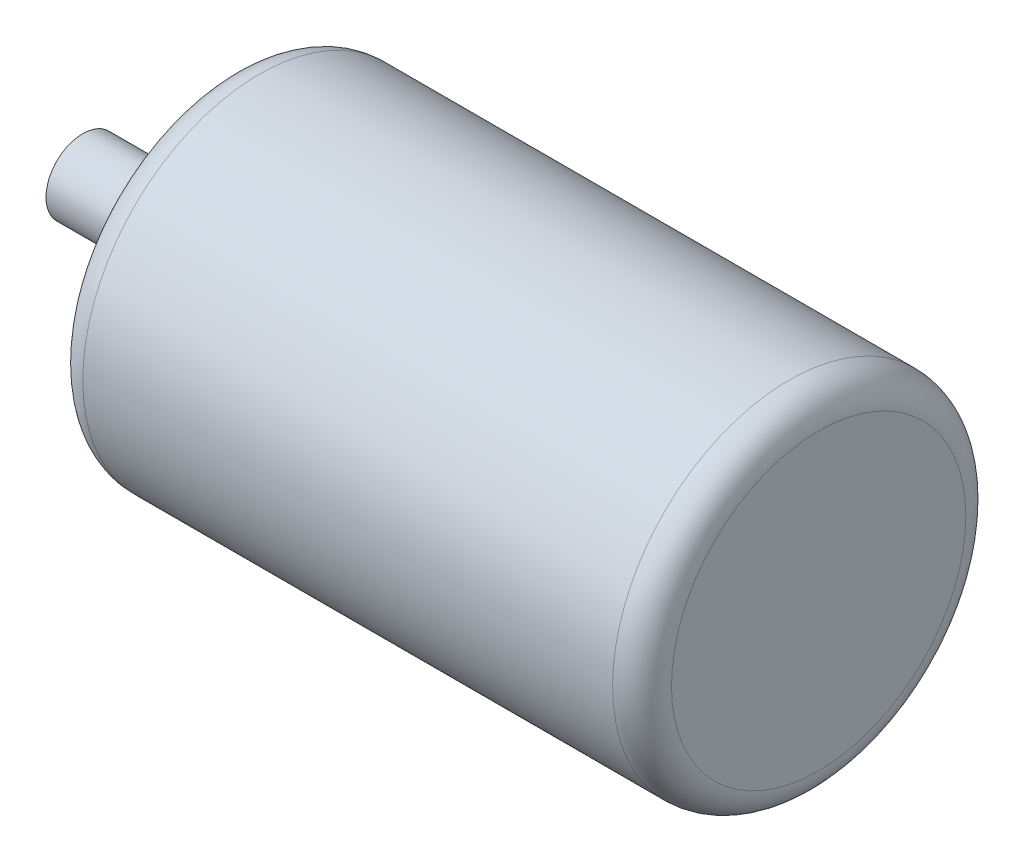
ISO-10303-21;
HEADER;
FILE_DESCRIPTION(('STEP AP214'),'2;1');
FILE_NAME('part.step','',(''),(''),'','','');
FILE_SCHEMA(('AUTOMOTIVE_DESIGN { 1 0 10303 214 1 1 1 1 }'));
ENDSEC;
DATA;
#1=APPLICATION_CONTEXT('core data for automotive mechanical design processes');
#2=APPLICATION_PROTOCOL_DEFINITION('international standard','automotive_design',2000,#1);
#3=PRODUCT_CONTEXT('',#1,'mechanical');
#4=PRODUCT('Part','Part','',(#3));
#5=PRODUCT_RELATED_PRODUCT_CATEGORY('part','',(#4));
#6=PRODUCT_DEFINITION_FORMATION('','',#4);
#7=PRODUCT_DEFINITION_CONTEXT('part definition',#1,'design');
#8=PRODUCT_DEFINITION('design','',#6,#7);
#9=PRODUCT_DEFINITION_SHAPE('','',#8);
#10=(LENGTH_UNIT() NAMED_UNIT(*) SI_UNIT(.MILLI.,.METRE.));
#11=(NAMED_UNIT(*) PLANE_ANGLE_UNIT() SI_UNIT($,.RADIAN.));
#12=(NAMED_UNIT(*) SI_UNIT($,.STERADIAN.) SOLID_ANGLE_UNIT());
#13=UNCERTAINTY_MEASURE_WITH_UNIT(LENGTH_MEASURE(1.E-05),#10,'distance_accuracy_value','');
#14=(GEOMETRIC_REPRESENTATION_CONTEXT(3) GLOBAL_UNCERTAINTY_ASSIGNED_CONTEXT((#13)) GLOBAL_UNIT_ASSIGNED_CONTEXT((#10,
#11,#12)) REPRESENTATION_CONTEXT('',''));
#15=CARTESIAN_POINT('',(0.,0.,0.));
#16=DIRECTION('',(0.,0.,1.));
#17=DIRECTION('',(1.,0.,0.));
#18=AXIS2_PLACEMENT_3D('',#15,#16,#17);
#19=CARTESIAN_POINT('',(-50.,0.,0.));
#20=DIRECTION('',(1.,0.,0.));
#21=DIRECTION('',(0.,0.,-1.));
#22=AXIS2_PLACEMENT_3D('',#19,#20,#21);
#23=CYLINDRICAL_SURFACE('',#22,60.);
#24=CARTESIAN_POINT('',(10.,0.,0.));
#25=DIRECTION('',(-1.,0.,0.));
#26=DIRECTION('',(0.,0.,1.));
#27=AXIS2_PLACEMENT_3D('',#24,#25,#26);
#28=CIRCLE('',#27,60.);
#29=CARTESIAN_POINT('',(10.,0.,60.));
#30=VERTEX_POINT('',#29);
#31=EDGE_CURVE('E50',#30,#30,#28,.F.);
#32=ORIENTED_EDGE('',*,*,#31,.T.);
#33=EDGE_LOOP('',(#32));
#34=FACE_BOUND('',#33,.T.);
#35=CARTESIAN_POINT('',(190.,0.,0.));
#36=DIRECTION('',(1.,0.,0.));
#37=DIRECTION('',(0.,0.,-1.));
#38=AXIS2_PLACEMENT_3D('',#35,#36,#37);
#39=CIRCLE('',#38,60.);
#40=CARTESIAN_POINT('',(190.,0.,-60.));
#41=VERTEX_POINT('',#40);
#42=EDGE_CURVE('E55',#41,#41,#39,.F.);
#43=ORIENTED_EDGE('',*,*,#42,.T.);
#44=EDGE_LOOP('',(#43));
#45=FACE_BOUND('',#44,.T.);
#46=ADVANCED_FACE('F37',(#34,#45),#23,.T.);
#47=CARTESIAN_POINT('',(200.,0.,0.));
#48=DIRECTION('',(1.,0.,0.));
#49=DIRECTION('',(0.,0.,-1.));
#50=AXIS2_PLACEMENT_3D('',#47,#48,#49);
#51=PLANE('',#50);
#52=CARTESIAN_POINT('',(200.,0.,0.));
#53=DIRECTION('',(1.,0.,0.));
#54=DIRECTION('',(0.,0.,-1.));
#55=AXIS2_PLACEMENT_3D('',#52,#53,#54);
#56=CIRCLE('',#55,50.);
#57=CARTESIAN_POINT('',(200.,0.,-50.));
#58=VERTEX_POINT('',#57);
#59=EDGE_CURVE('E10',#58,#58,#56,.T.);
#60=ORIENTED_EDGE('',*,*,#59,.T.);
#61=EDGE_LOOP('',(#60));
#62=FACE_BOUND('',#61,.T.);
#63=ADVANCED_FACE('F75',(#62),#51,.T.);
#64=CARTESIAN_POINT('',(0.,0.,0.));
#65=DIRECTION('',(-1.,0.,0.));
#66=DIRECTION('',(0.,0.,1.));
#67=AXIS2_PLACEMENT_3D('',#64,#65,#66);
#68=PLANE('',#67);
#69=CARTESIAN_POINT('',(0.,0.,0.));
#70=DIRECTION('',(-1.,0.,0.));
#71=DIRECTION('',(0.,0.,1.));
#72=AXIS2_PLACEMENT_3D('',#69,#70,#71);
#73=CIRCLE('',#72,50.);
#74=CARTESIAN_POINT('',(0.,0.,50.));
#75=VERTEX_POINT('',#74);
#76=EDGE_CURVE('E45',#75,#75,#73,.T.);
#77=ORIENTED_EDGE('',*,*,#76,.T.);
#78=EDGE_LOOP('',(#77));
#79=FACE_BOUND('',#78,.T.);
#80=CARTESIAN_POINT('',(0.,0.,0.));
#81=DIRECTION('',(-1.,0.,0.));
#82=DIRECTION('',(0.,0.,1.));
#83=AXIS2_PLACEMENT_3D('',#80,#81,#82);
#84=CIRCLE('',#83,12.5);
#85=CARTESIAN_POINT('',(0.,0.,12.5));
#86=VERTEX_POINT('',#85);
#87=EDGE_CURVE('E61',#86,#86,#84,.T.);
#88=ORIENTED_EDGE('',*,*,#87,.F.);
#89=EDGE_LOOP('',(#88));
#90=FACE_BOUND('',#89,.T.);
#91=ADVANCED_FACE('F73',(#79,#90),#68,.T.);
#92=CARTESIAN_POINT('',(0.,0.,0.));
#93=DIRECTION('',(-1.,0.,0.));
#94=DIRECTION('',(0.,0.,1.));
#95=AXIS2_PLACEMENT_3D('',#92,#93,#94);
#96=CYLINDRICAL_SURFACE('',#95,12.5);
#97=ORIENTED_EDGE('',*,*,#87,.T.);
#98=EDGE_LOOP('',(#97));
#99=FACE_BOUND('',#98,.T.);
#100=CARTESIAN_POINT('',(-50.,0.,0.));
#101=DIRECTION('',(-1.,0.,0.));
#102=DIRECTION('',(0.,0.,1.));
#103=AXIS2_PLACEMENT_3D('',#100,#101,#102);
#104=CIRCLE('',#103,12.5);
#105=CARTESIAN_POINT('',(-50.,0.,12.5));
#106=VERTEX_POINT('',#105);
#107=EDGE_CURVE('E62',#106,#106,#104,.T.);
#108=ORIENTED_EDGE('',*,*,#107,.F.);
#109=EDGE_LOOP('',(#108));
#110=FACE_BOUND('',#109,.T.);
#111=ADVANCED_FACE('F70',(#99,#110),#96,.T.);
#112=CARTESIAN_POINT('',(-50.,0.,0.));
#113=DIRECTION('',(1.,0.,0.));
#114=DIRECTION('',(0.,0.,-1.));
#115=AXIS2_PLACEMENT_3D('',#112,#113,#114);
#116=PLANE('',#115);
#117=ORIENTED_EDGE('',*,*,#107,.T.);
#118=EDGE_LOOP('',(#117));
#119=FACE_BOUND('',#118,.T.);
#120=ADVANCED_FACE('F81',(#119),#116,.F.);
#121=CARTESIAN_POINT('',(10.,0.,0.));
#122=DIRECTION('',(-1.,0.,0.));
#123=DIRECTION('',(0.,0.,1.));
#124=AXIS2_PLACEMENT_3D('',#121,#122,#123);
#125=TOROIDAL_SURFACE('',#124,50.,10.);
#126=ORIENTED_EDGE('',*,*,#76,.F.);
#127=EDGE_LOOP('',(#126));
#128=FACE_BOUND('',#127,.T.);
#129=ORIENTED_EDGE('',*,*,#31,.F.);
#130=EDGE_LOOP('',(#129));
#131=FACE_BOUND('',#130,.T.);
#132=ADVANCED_FACE('F91',(#128,#131),#125,.T.);
#133=CARTESIAN_POINT('',(190.,0.,0.));
#134=DIRECTION('',(1.,0.,0.));
#135=DIRECTION('',(0.,0.,-1.));
#136=AXIS2_PLACEMENT_3D('',#133,#134,#135);
#137=TOROIDAL_SURFACE('',#136,50.,10.);
#138=ORIENTED_EDGE('',*,*,#42,.F.);
#139=EDGE_LOOP('',(#138));
#140=FACE_BOUND('',#139,.T.);
#141=ORIENTED_EDGE('',*,*,#59,.F.);
#142=EDGE_LOOP('',(#141));
#143=FACE_BOUND('',#142,.T.);
#144=ADVANCED_FACE('F39',(#140,#143),#137,.T.);
#145=CLOSED_SHELL('',(#46,#63,#91,#111,#120,#132,#144));
#146=MANIFOLD_SOLID_BREP('B2',#145);
#147=ADVANCED_BREP_SHAPE_REPRESENTATION('',(#18,#146),#14);
#148=SHAPE_DEFINITION_REPRESENTATION(#9,#147);
ENDSEC;
END-ISO-10303-21;
